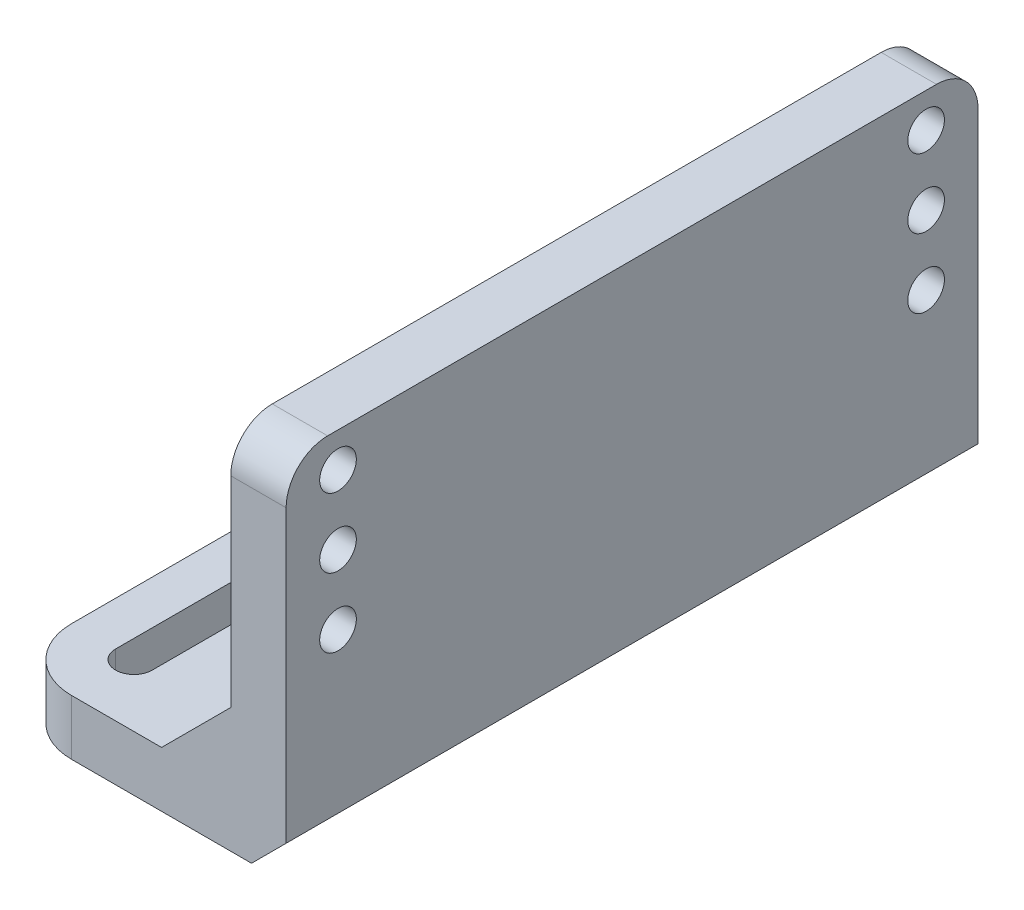
ISO-10303-21;
HEADER;
FILE_DESCRIPTION(('STEP AP214'),'2;1');
FILE_NAME('part.step','',(''),(''),'','','');
FILE_SCHEMA(('AUTOMOTIVE_DESIGN { 1 0 10303 214 1 1 1 1 }'));
ENDSEC;
DATA;
#1=APPLICATION_CONTEXT('core data for automotive mechanical design processes');
#2=APPLICATION_PROTOCOL_DEFINITION('international standard','automotive_design',2000,#1);
#3=PRODUCT_CONTEXT('',#1,'mechanical');
#4=PRODUCT('Part','Part','',(#3));
#5=PRODUCT_RELATED_PRODUCT_CATEGORY('part','',(#4));
#6=PRODUCT_DEFINITION_FORMATION('','',#4);
#7=PRODUCT_DEFINITION_CONTEXT('part definition',#1,'design');
#8=PRODUCT_DEFINITION('design','',#6,#7);
#9=PRODUCT_DEFINITION_SHAPE('','',#8);
#10=(LENGTH_UNIT() NAMED_UNIT(*) SI_UNIT(.MILLI.,.METRE.));
#11=(NAMED_UNIT(*) PLANE_ANGLE_UNIT() SI_UNIT($,.RADIAN.));
#12=(NAMED_UNIT(*) SI_UNIT($,.STERADIAN.) SOLID_ANGLE_UNIT());
#13=UNCERTAINTY_MEASURE_WITH_UNIT(LENGTH_MEASURE(1.E-05),#10,'distance_accuracy_value','');
#14=(GEOMETRIC_REPRESENTATION_CONTEXT(3) GLOBAL_UNCERTAINTY_ASSIGNED_CONTEXT((#13)) GLOBAL_UNIT_ASSIGNED_CONTEXT((#10,
#11,#12)) REPRESENTATION_CONTEXT('',''));
#15=CARTESIAN_POINT('',(0.,0.,0.));
#16=DIRECTION('',(0.,0.,1.));
#17=DIRECTION('',(1.,0.,0.));
#18=AXIS2_PLACEMENT_3D('',#15,#16,#17);
#19=CARTESIAN_POINT('',(0.,8.,0.));
#20=DIRECTION('',(-1.,0.,0.));
#21=DIRECTION('',(0.,0.,-1.));
#22=AXIS2_PLACEMENT_3D('',#19,#20,#21);
#23=PLANE('',#22);
#24=CARTESIAN_POINT('',(0.,38.,-92.5));
#25=DIRECTION('',(1.,0.,0.));
#26=DIRECTION('',(0.,0.,-1.));
#27=AXIS2_PLACEMENT_3D('',#24,#25,#26);
#28=CIRCLE('',#27,2.65);
#29=CARTESIAN_POINT('',(0.,38.,-95.15));
#30=VERTEX_POINT('',#29);
#31=EDGE_CURVE('E253',#30,#30,#28,.T.);
#32=ORIENTED_EDGE('',*,*,#31,.F.);
#33=EDGE_LOOP('',(#32));
#34=FACE_BOUND('',#33,.T.);
#35=CARTESIAN_POINT('',(0.,48.,-92.5));
#36=DIRECTION('',(1.,0.,0.));
#37=DIRECTION('',(0.,0.,-1.));
#38=AXIS2_PLACEMENT_3D('',#35,#36,#37);
#39=CIRCLE('',#38,2.65);
#40=CARTESIAN_POINT('',(0.,48.,-95.15));
#41=VERTEX_POINT('',#40);
#42=EDGE_CURVE('E260',#41,#41,#39,.T.);
#43=ORIENTED_EDGE('',*,*,#42,.F.);
#44=EDGE_LOOP('',(#43));
#45=FACE_BOUND('',#44,.T.);
#46=CARTESIAN_POINT('',(0.,48.,-7.5));
#47=DIRECTION('',(1.,0.,0.));
#48=DIRECTION('',(0.,0.,-1.));
#49=AXIS2_PLACEMENT_3D('',#46,#47,#48);
#50=CIRCLE('',#49,2.65);
#51=CARTESIAN_POINT('',(0.,48.,-10.15));
#52=VERTEX_POINT('',#51);
#53=EDGE_CURVE('E259',#52,#52,#50,.T.);
#54=ORIENTED_EDGE('',*,*,#53,.F.);
#55=EDGE_LOOP('',(#54));
#56=FACE_BOUND('',#55,.T.);
#57=CARTESIAN_POINT('',(0.,28.,-92.5));
#58=DIRECTION('',(1.,0.,0.));
#59=DIRECTION('',(0.,0.,-1.));
#60=AXIS2_PLACEMENT_3D('',#57,#58,#59);
#61=CIRCLE('',#60,2.65);
#62=CARTESIAN_POINT('',(0.,28.,-95.15));
#63=VERTEX_POINT('',#62);
#64=EDGE_CURVE('E272',#63,#63,#61,.T.);
#65=ORIENTED_EDGE('',*,*,#64,.F.);
#66=EDGE_LOOP('',(#65));
#67=FACE_BOUND('',#66,.T.);
#68=CARTESIAN_POINT('',(0.,38.,-7.50000000000001));
#69=DIRECTION('',(1.,0.,0.));
#70=DIRECTION('',(0.,0.,1.));
#71=AXIS2_PLACEMENT_3D('',#68,#69,#70);
#72=CIRCLE('',#71,2.65);
#73=CARTESIAN_POINT('',(0.,38.,-4.85));
#74=VERTEX_POINT('',#73);
#75=EDGE_CURVE('E215',#74,#74,#72,.T.);
#76=ORIENTED_EDGE('',*,*,#75,.F.);
#77=EDGE_LOOP('',(#76));
#78=FACE_BOUND('',#77,.T.);
#79=CARTESIAN_POINT('',(0.,28.,-7.5));
#80=DIRECTION('',(1.,0.,0.));
#81=DIRECTION('',(0.,0.,1.));
#82=AXIS2_PLACEMENT_3D('',#79,#80,#81);
#83=CIRCLE('',#82,2.65);
#84=CARTESIAN_POINT('',(0.,28.,-4.85));
#85=VERTEX_POINT('',#84);
#86=EDGE_CURVE('E280',#85,#85,#83,.T.);
#87=ORIENTED_EDGE('',*,*,#86,.F.);
#88=EDGE_LOOP('',(#87));
#89=FACE_BOUND('',#88,.T.);
#90=DIRECTION('',(0.,-1.,0.));
#91=VECTOR('',#90,1.);
#92=CARTESIAN_POINT('',(0.,8.,-100.));
#93=LINE('',#92,#91);
#94=CARTESIAN_POINT('',(0.,47.,-100.));
#95=VERTEX_POINT('',#94);
#96=CARTESIAN_POINT('',(0.,5.,-100.));
#97=VERTEX_POINT('',#96);
#98=EDGE_CURVE('E308',#95,#97,#93,.T.);
#99=ORIENTED_EDGE('',*,*,#98,.F.);
#100=CARTESIAN_POINT('',(0.,47.,-94.));
#101=DIRECTION('',(1.,0.,0.));
#102=DIRECTION('',(0.,0.,-1.));
#103=AXIS2_PLACEMENT_3D('',#100,#101,#102);
#104=CIRCLE('',#103,6.);
#105=CARTESIAN_POINT('',(0.,53.,-94.));
#106=VERTEX_POINT('',#105);
#107=EDGE_CURVE('E326',#106,#95,#104,.F.);
#108=ORIENTED_EDGE('',*,*,#107,.F.);
#109=DIRECTION('',(0.,0.,-1.));
#110=VECTOR('',#109,1.);
#111=CARTESIAN_POINT('',(0.,53.,-100.));
#112=LINE('',#111,#110);
#113=CARTESIAN_POINT('',(0.,53.,-6.00000000000001));
#114=VERTEX_POINT('',#113);
#115=EDGE_CURVE('E283',#114,#106,#112,.T.);
#116=ORIENTED_EDGE('',*,*,#115,.F.);
#117=CARTESIAN_POINT('',(0.,47.,-6.));
#118=DIRECTION('',(1.,0.,0.));
#119=DIRECTION('',(0.,0.,-1.));
#120=AXIS2_PLACEMENT_3D('',#117,#118,#119);
#121=CIRCLE('',#120,6.);
#122=CARTESIAN_POINT('',(0.,47.,0.));
#123=VERTEX_POINT('',#122);
#124=EDGE_CURVE('E323',#123,#114,#121,.F.);
#125=ORIENTED_EDGE('',*,*,#124,.F.);
#126=DIRECTION('',(0.,-1.,0.));
#127=VECTOR('',#126,1.);
#128=CARTESIAN_POINT('',(0.,8.,0.));
#129=LINE('',#128,#127);
#130=CARTESIAN_POINT('',(0.,5.,0.));
#131=VERTEX_POINT('',#130);
#132=EDGE_CURVE('E316',#123,#131,#129,.T.);
#133=ORIENTED_EDGE('',*,*,#132,.T.);
#134=DIRECTION('',(0.,0.,1.));
#135=VECTOR('',#134,1.);
#136=CARTESIAN_POINT('',(0.,5.,0.));
#137=LINE('',#136,#135);
#138=EDGE_CURVE('E369',#97,#131,#137,.T.);
#139=ORIENTED_EDGE('',*,*,#138,.F.);
#140=EDGE_LOOP('',(#99,#108,#116,#125,#133,#139));
#141=FACE_BOUND('',#140,.T.);
#142=ADVANCED_FACE('F40',(#34,#45,#56,#67,#78,#89,#141),#23,.F.);
#143=CARTESIAN_POINT('',(0.,8.,0.));
#144=DIRECTION('',(0.,0.,-1.));
#145=DIRECTION('',(1.,0.,0.));
#146=AXIS2_PLACEMENT_3D('',#143,#144,#145);
#147=PLANE('',#146);
#148=ORIENTED_EDGE('',*,*,#132,.F.);
#149=DIRECTION('',(1.,0.,0.));
#150=VECTOR('',#149,1.);
#151=CARTESIAN_POINT('',(0.,47.,0.));
#152=LINE('',#151,#150);
#153=CARTESIAN_POINT('',(-8.,47.,0.));
#154=VERTEX_POINT('',#153);
#155=EDGE_CURVE('E337',#154,#123,#152,.T.);
#156=ORIENTED_EDGE('',*,*,#155,.F.);
#157=DIRECTION('',(0.,1.,0.));
#158=VECTOR('',#157,1.);
#159=CARTESIAN_POINT('',(-8.,0.,0.));
#160=LINE('',#159,#158);
#161=CARTESIAN_POINT('',(-8.,17.9999999999999,0.));
#162=VERTEX_POINT('',#161);
#163=EDGE_CURVE('E289',#162,#154,#160,.T.);
#164=ORIENTED_EDGE('',*,*,#163,.F.);
#165=DIRECTION('',(0.707106781186551,0.707106781186544,0.));
#166=VECTOR('',#165,1.);
#167=CARTESIAN_POINT('',(-8.99999999999993,17.,0.));
#168=LINE('',#167,#166);
#169=CARTESIAN_POINT('',(-18.,8.,0.));
#170=VERTEX_POINT('',#169);
#171=EDGE_CURVE('E343',#170,#162,#168,.T.);
#172=ORIENTED_EDGE('',*,*,#171,.F.);
#173=DIRECTION('',(-1.,0.,0.));
#174=VECTOR('',#173,1.);
#175=CARTESIAN_POINT('',(0.,8.,0.));
#176=LINE('',#175,#174);
#177=CARTESIAN_POINT('',(-31.,8.,0.));
#178=VERTEX_POINT('',#177);
#179=EDGE_CURVE('E298',#170,#178,#176,.T.);
#180=ORIENTED_EDGE('',*,*,#179,.T.);
#181=DIRECTION('',(0.,-1.,0.));
#182=VECTOR('',#181,1.);
#183=CARTESIAN_POINT('',(-31.,8.,0.));
#184=LINE('',#183,#182);
#185=CARTESIAN_POINT('',(-31.,0.,0.));
#186=VERTEX_POINT('',#185);
#187=EDGE_CURVE('E366',#186,#178,#184,.F.);
#188=ORIENTED_EDGE('',*,*,#187,.F.);
#189=DIRECTION('',(-1.,0.,0.));
#190=VECTOR('',#189,1.);
#191=CARTESIAN_POINT('',(0.,0.,0.));
#192=LINE('',#191,#190);
#193=CARTESIAN_POINT('',(-5.00000000000002,0.,0.));
#194=VERTEX_POINT('',#193);
#195=EDGE_CURVE('E295',#194,#186,#192,.T.);
#196=ORIENTED_EDGE('',*,*,#195,.F.);
#197=DIRECTION('',(-0.707106781186549,-0.707106781186547,0.));
#198=VECTOR('',#197,1.);
#199=CARTESIAN_POINT('',(0.,5.,0.));
#200=LINE('',#199,#198);
#201=EDGE_CURVE('E372',#131,#194,#200,.T.);
#202=ORIENTED_EDGE('',*,*,#201,.F.);
#203=EDGE_LOOP('',(#148,#156,#164,#172,#180,#188,#196,#202));
#204=FACE_BOUND('',#203,.T.);
#205=ADVANCED_FACE('F378',(#204),#147,.F.);
#206=CARTESIAN_POINT('',(-40.,8.,0.));
#207=DIRECTION('',(1.,0.,0.));
#208=DIRECTION('',(0.,0.,1.));
#209=AXIS2_PLACEMENT_3D('',#206,#207,#208);
#210=PLANE('',#209);
#211=DIRECTION('',(0.,0.,-1.));
#212=VECTOR('',#211,1.);
#213=CARTESIAN_POINT('',(-40.,0.,0.));
#214=LINE('',#213,#212);
#215=CARTESIAN_POINT('',(-40.,0.,-8.99999999999998));
#216=VERTEX_POINT('',#215);
#217=CARTESIAN_POINT('',(-40.,0.,-91.));
#218=VERTEX_POINT('',#217);
#219=EDGE_CURVE('E310',#216,#218,#214,.T.);
#220=ORIENTED_EDGE('',*,*,#219,.F.);
#221=DIRECTION('',(0.,-1.,0.));
#222=VECTOR('',#221,1.);
#223=CARTESIAN_POINT('',(-40.,8.,-8.99999999999998));
#224=LINE('',#223,#222);
#225=CARTESIAN_POINT('',(-40.,8.,-8.99999999999998));
#226=VERTEX_POINT('',#225);
#227=EDGE_CURVE('E356',#226,#216,#224,.T.);
#228=ORIENTED_EDGE('',*,*,#227,.F.);
#229=DIRECTION('',(0.,0.,-1.));
#230=VECTOR('',#229,1.);
#231=CARTESIAN_POINT('',(-40.,8.,0.));
#232=LINE('',#231,#230);
#233=CARTESIAN_POINT('',(-40.,8.,-91.));
#234=VERTEX_POINT('',#233);
#235=EDGE_CURVE('E301',#226,#234,#232,.T.);
#236=ORIENTED_EDGE('',*,*,#235,.T.);
#237=DIRECTION('',(0.,-1.,0.));
#238=VECTOR('',#237,1.);
#239=CARTESIAN_POINT('',(-40.,8.,-91.));
#240=LINE('',#239,#238);
#241=EDGE_CURVE('E359',#218,#234,#240,.F.);
#242=ORIENTED_EDGE('',*,*,#241,.F.);
#243=EDGE_LOOP('',(#220,#228,#236,#242));
#244=FACE_BOUND('',#243,.T.);
#245=ADVANCED_FACE('F386',(#244),#210,.F.);
#246=CARTESIAN_POINT('',(0.,8.,-100.));
#247=DIRECTION('',(0.,0.,1.));
#248=DIRECTION('',(-1.,0.,0.));
#249=AXIS2_PLACEMENT_3D('',#246,#247,#248);
#250=PLANE('',#249);
#251=DIRECTION('',(1.,0.,0.));
#252=VECTOR('',#251,1.);
#253=CARTESIAN_POINT('',(0.,0.,-100.));
#254=LINE('',#253,#252);
#255=CARTESIAN_POINT('',(-31.,0.,-100.));
#256=VERTEX_POINT('',#255);
#257=CARTESIAN_POINT('',(-5.00000000000005,0.,-100.));
#258=VERTEX_POINT('',#257);
#259=EDGE_CURVE('E302',#256,#258,#254,.T.);
#260=ORIENTED_EDGE('',*,*,#259,.F.);
#261=DIRECTION('',(0.,-1.,0.));
#262=VECTOR('',#261,1.);
#263=CARTESIAN_POINT('',(-31.,8.,-100.));
#264=LINE('',#263,#262);
#265=CARTESIAN_POINT('',(-31.,8.,-100.));
#266=VERTEX_POINT('',#265);
#267=EDGE_CURVE('E349',#266,#256,#264,.T.);
#268=ORIENTED_EDGE('',*,*,#267,.F.);
#269=DIRECTION('',(1.,0.,0.));
#270=VECTOR('',#269,1.);
#271=CARTESIAN_POINT('',(0.,8.,-100.));
#272=LINE('',#271,#270);
#273=CARTESIAN_POINT('',(-18.0000000000001,8.,-100.));
#274=VERTEX_POINT('',#273);
#275=EDGE_CURVE('E305',#266,#274,#272,.T.);
#276=ORIENTED_EDGE('',*,*,#275,.T.);
#277=DIRECTION('',(-0.707106781186551,-0.707106781186544,0.));
#278=VECTOR('',#277,1.);
#279=CARTESIAN_POINT('',(-8.99999999999996,17.,-100.));
#280=LINE('',#279,#278);
#281=CARTESIAN_POINT('',(-8.00000000000004,17.9999999999999,-100.));
#282=VERTEX_POINT('',#281);
#283=EDGE_CURVE('E346',#282,#274,#280,.T.);
#284=ORIENTED_EDGE('',*,*,#283,.F.);
#285=DIRECTION('',(0.,-1.,0.));
#286=VECTOR('',#285,1.);
#287=CARTESIAN_POINT('',(-8.00000000000004,0.,-100.));
#288=LINE('',#287,#286);
#289=CARTESIAN_POINT('',(-8.00000000000004,47.,-100.));
#290=VERTEX_POINT('',#289);
#291=EDGE_CURVE('E286',#290,#282,#288,.T.);
#292=ORIENTED_EDGE('',*,*,#291,.F.);
#293=DIRECTION('',(1.,0.,0.));
#294=VECTOR('',#293,1.);
#295=CARTESIAN_POINT('',(-8.00000000000004,47.,-100.));
#296=LINE('',#295,#294);
#297=EDGE_CURVE('E329',#95,#290,#296,.F.);
#298=ORIENTED_EDGE('',*,*,#297,.F.);
#299=ORIENTED_EDGE('',*,*,#98,.T.);
#300=DIRECTION('',(0.707106781186549,0.707106781186547,0.));
#301=VECTOR('',#300,1.);
#302=CARTESIAN_POINT('',(0.,4.99999999999999,-100.));
#303=LINE('',#302,#301);
#304=EDGE_CURVE('E11',#258,#97,#303,.T.);
#305=ORIENTED_EDGE('',*,*,#304,.F.);
#306=EDGE_LOOP('',(#260,#268,#276,#284,#292,#298,#299,#305));
#307=FACE_BOUND('',#306,.T.);
#308=ADVANCED_FACE('F393',(#307),#250,.F.);
#309=CARTESIAN_POINT('',(0.,8.,0.));
#310=DIRECTION('',(0.,-1.,0.));
#311=DIRECTION('',(0.,0.,-1.));
#312=AXIS2_PLACEMENT_3D('',#309,#310,#311);
#313=PLANE('',#312);
#314=DIRECTION('',(0.,0.,1.));
#315=VECTOR('',#314,1.);
#316=CARTESIAN_POINT('',(-28.35,8.,-91.));
#317=LINE('',#316,#315);
#318=CARTESIAN_POINT('',(-28.35,8.,-91.));
#319=VERTEX_POINT('',#318);
#320=CARTESIAN_POINT('',(-28.35,8.,-66.));
#321=VERTEX_POINT('',#320);
#322=EDGE_CURVE('E180',#319,#321,#317,.T.);
#323=ORIENTED_EDGE('',*,*,#322,.T.);
#324=CARTESIAN_POINT('',(-31.,8.,-66.));
#325=DIRECTION('',(0.,-1.,0.));
#326=DIRECTION('',(0.,0.,1.));
#327=AXIS2_PLACEMENT_3D('',#324,#325,#326);
#328=CIRCLE('',#327,2.65);
#329=CARTESIAN_POINT('',(-33.65,8.,-66.));
#330=VERTEX_POINT('',#329);
#331=EDGE_CURVE('E203',#321,#330,#328,.T.);
#332=ORIENTED_EDGE('',*,*,#331,.T.);
#333=DIRECTION('',(0.,0.,-1.));
#334=VECTOR('',#333,1.);
#335=CARTESIAN_POINT('',(-33.65,8.,-91.));
#336=LINE('',#335,#334);
#337=CARTESIAN_POINT('',(-33.65,8.,-91.));
#338=VERTEX_POINT('',#337);
#339=EDGE_CURVE('E200',#330,#338,#336,.T.);
#340=ORIENTED_EDGE('',*,*,#339,.T.);
#341=CARTESIAN_POINT('',(-31.,8.,-91.));
#342=DIRECTION('',(0.,-1.,0.));
#343=DIRECTION('',(0.,0.,1.));
#344=AXIS2_PLACEMENT_3D('',#341,#342,#343);
#345=CIRCLE('',#344,2.65);
#346=EDGE_CURVE('E208',#338,#319,#345,.T.);
#347=ORIENTED_EDGE('',*,*,#346,.T.);
#348=EDGE_LOOP('',(#323,#332,#340,#347));
#349=FACE_BOUND('',#348,.T.);
#350=DIRECTION('',(0.,0.,1.));
#351=VECTOR('',#350,1.);
#352=CARTESIAN_POINT('',(-28.35,8.,-34.));
#353=LINE('',#352,#351);
#354=CARTESIAN_POINT('',(-28.35,8.,-34.));
#355=VERTEX_POINT('',#354);
#356=CARTESIAN_POINT('',(-28.35,8.,-8.99999999999998));
#357=VERTEX_POINT('',#356);
#358=EDGE_CURVE('E235',#355,#357,#353,.T.);
#359=ORIENTED_EDGE('',*,*,#358,.T.);
#360=CARTESIAN_POINT('',(-31.,8.,-8.99999999999998));
#361=DIRECTION('',(0.,-1.,0.));
#362=DIRECTION('',(0.,0.,1.));
#363=AXIS2_PLACEMENT_3D('',#360,#361,#362);
#364=CIRCLE('',#363,2.64999999999999);
#365=CARTESIAN_POINT('',(-33.65,8.,-8.99999999999998));
#366=VERTEX_POINT('',#365);
#367=EDGE_CURVE('E231',#357,#366,#364,.T.);
#368=ORIENTED_EDGE('',*,*,#367,.T.);
#369=DIRECTION('',(0.,0.,-1.));
#370=VECTOR('',#369,1.);
#371=CARTESIAN_POINT('',(-33.65,8.,-34.));
#372=LINE('',#371,#370);
#373=CARTESIAN_POINT('',(-33.65,8.,-34.));
#374=VERTEX_POINT('',#373);
#375=EDGE_CURVE('E228',#366,#374,#372,.T.);
#376=ORIENTED_EDGE('',*,*,#375,.T.);
#377=CARTESIAN_POINT('',(-31.,8.,-34.));
#378=DIRECTION('',(0.,-1.,0.));
#379=DIRECTION('',(0.,0.,1.));
#380=AXIS2_PLACEMENT_3D('',#377,#378,#379);
#381=CIRCLE('',#380,2.65);
#382=EDGE_CURVE('E210',#374,#355,#381,.T.);
#383=ORIENTED_EDGE('',*,*,#382,.T.);
#384=EDGE_LOOP('',(#359,#368,#376,#383));
#385=FACE_BOUND('',#384,.T.);
#386=ORIENTED_EDGE('',*,*,#235,.F.);
#387=CARTESIAN_POINT('',(-31.,8.,-8.99999999999998));
#388=DIRECTION('',(0.,1.,0.));
#389=DIRECTION('',(0.,0.,-1.));
#390=AXIS2_PLACEMENT_3D('',#387,#388,#389);
#391=CIRCLE('',#390,9.);
#392=EDGE_CURVE('E362',#178,#226,#391,.F.);
#393=ORIENTED_EDGE('',*,*,#392,.F.);
#394=ORIENTED_EDGE('',*,*,#179,.F.);
#395=DIRECTION('',(0.,0.,1.));
#396=VECTOR('',#395,1.);
#397=CARTESIAN_POINT('',(-18.,8.,0.));
#398=LINE('',#397,#396);
#399=EDGE_CURVE('E339',#274,#170,#398,.T.);
#400=ORIENTED_EDGE('',*,*,#399,.F.);
#401=ORIENTED_EDGE('',*,*,#275,.F.);
#402=CARTESIAN_POINT('',(-31.,8.,-91.));
#403=DIRECTION('',(0.,1.,0.));
#404=DIRECTION('',(0.,0.,-1.));
#405=AXIS2_PLACEMENT_3D('',#402,#403,#404);
#406=CIRCLE('',#405,9.);
#407=EDGE_CURVE('E364',#234,#266,#406,.F.);
#408=ORIENTED_EDGE('',*,*,#407,.F.);
#409=EDGE_LOOP('',(#386,#393,#394,#400,#401,#408));
#410=FACE_BOUND('',#409,.T.);
#411=ADVANCED_FACE('F414',(#349,#385,#410),#313,.F.);
#412=CARTESIAN_POINT('',(0.,0.,0.));
#413=DIRECTION('',(0.,-1.,0.));
#414=DIRECTION('',(0.,0.,-1.));
#415=AXIS2_PLACEMENT_3D('',#412,#413,#414);
#416=PLANE('',#415);
#417=CARTESIAN_POINT('',(-31.,0.,-91.));
#418=DIRECTION('',(0.,-1.,0.));
#419=DIRECTION('',(0.,0.,1.));
#420=AXIS2_PLACEMENT_3D('',#417,#418,#419);
#421=CIRCLE('',#420,2.65);
#422=CARTESIAN_POINT('',(-33.65,0.,-91.));
#423=VERTEX_POINT('',#422);
#424=CARTESIAN_POINT('',(-28.35,0.,-91.));
#425=VERTEX_POINT('',#424);
#426=EDGE_CURVE('E193',#423,#425,#421,.T.);
#427=ORIENTED_EDGE('',*,*,#426,.F.);
#428=DIRECTION('',(0.,0.,-1.));
#429=VECTOR('',#428,1.);
#430=CARTESIAN_POINT('',(-33.65,0.,-91.));
#431=LINE('',#430,#429);
#432=CARTESIAN_POINT('',(-33.65,0.,-66.));
#433=VERTEX_POINT('',#432);
#434=EDGE_CURVE('E186',#433,#423,#431,.T.);
#435=ORIENTED_EDGE('',*,*,#434,.F.);
#436=CARTESIAN_POINT('',(-31.,0.,-66.));
#437=DIRECTION('',(0.,-1.,0.));
#438=DIRECTION('',(0.,0.,1.));
#439=AXIS2_PLACEMENT_3D('',#436,#437,#438);
#440=CIRCLE('',#439,2.65);
#441=CARTESIAN_POINT('',(-28.35,0.,-66.));
#442=VERTEX_POINT('',#441);
#443=EDGE_CURVE('E195',#442,#433,#440,.T.);
#444=ORIENTED_EDGE('',*,*,#443,.F.);
#445=DIRECTION('',(0.,0.,1.));
#446=VECTOR('',#445,1.);
#447=CARTESIAN_POINT('',(-28.35,0.,-91.));
#448=LINE('',#447,#446);
#449=EDGE_CURVE('E177',#425,#442,#448,.T.);
#450=ORIENTED_EDGE('',*,*,#449,.F.);
#451=EDGE_LOOP('',(#427,#435,#444,#450));
#452=FACE_BOUND('',#451,.T.);
#453=CARTESIAN_POINT('',(-31.,0.,-34.));
#454=DIRECTION('',(0.,-1.,0.));
#455=DIRECTION('',(0.,0.,1.));
#456=AXIS2_PLACEMENT_3D('',#453,#454,#455);
#457=CIRCLE('',#456,2.65);
#458=CARTESIAN_POINT('',(-33.65,0.,-34.));
#459=VERTEX_POINT('',#458);
#460=CARTESIAN_POINT('',(-28.35,0.,-34.));
#461=VERTEX_POINT('',#460);
#462=EDGE_CURVE('E232',#459,#461,#457,.T.);
#463=ORIENTED_EDGE('',*,*,#462,.F.);
#464=DIRECTION('',(0.,0.,-1.));
#465=VECTOR('',#464,1.);
#466=CARTESIAN_POINT('',(-33.65,0.,-34.));
#467=LINE('',#466,#465);
#468=CARTESIAN_POINT('',(-33.65,0.,-8.99999999999998));
#469=VERTEX_POINT('',#468);
#470=EDGE_CURVE('E221',#469,#459,#467,.T.);
#471=ORIENTED_EDGE('',*,*,#470,.F.);
#472=CARTESIAN_POINT('',(-31.,0.,-8.99999999999998));
#473=DIRECTION('',(0.,-1.,0.));
#474=DIRECTION('',(0.,0.,1.));
#475=AXIS2_PLACEMENT_3D('',#472,#473,#474);
#476=CIRCLE('',#475,2.64999999999999);
#477=CARTESIAN_POINT('',(-28.35,0.,-8.99999999999998));
#478=VERTEX_POINT('',#477);
#479=EDGE_CURVE('E242',#478,#469,#476,.T.);
#480=ORIENTED_EDGE('',*,*,#479,.F.);
#481=DIRECTION('',(0.,0.,1.));
#482=VECTOR('',#481,1.);
#483=CARTESIAN_POINT('',(-28.35,0.,-34.));
#484=LINE('',#483,#482);
#485=EDGE_CURVE('E245',#461,#478,#484,.T.);
#486=ORIENTED_EDGE('',*,*,#485,.F.);
#487=EDGE_LOOP('',(#463,#471,#480,#486));
#488=FACE_BOUND('',#487,.T.);
#489=ORIENTED_EDGE('',*,*,#195,.T.);
#490=CARTESIAN_POINT('',(-31.,0.,-8.99999999999998));
#491=DIRECTION('',(0.,1.,0.));
#492=DIRECTION('',(0.,0.,-1.));
#493=AXIS2_PLACEMENT_3D('',#490,#491,#492);
#494=CIRCLE('',#493,9.);
#495=EDGE_CURVE('E352',#216,#186,#494,.T.);
#496=ORIENTED_EDGE('',*,*,#495,.F.);
#497=ORIENTED_EDGE('',*,*,#219,.T.);
#498=CARTESIAN_POINT('',(-31.,0.,-91.));
#499=DIRECTION('',(0.,1.,0.));
#500=DIRECTION('',(0.,0.,-1.));
#501=AXIS2_PLACEMENT_3D('',#498,#499,#500);
#502=CIRCLE('',#501,9.);
#503=EDGE_CURVE('E354',#256,#218,#502,.T.);
#504=ORIENTED_EDGE('',*,*,#503,.F.);
#505=ORIENTED_EDGE('',*,*,#259,.T.);
#506=DIRECTION('',(0.,0.,-1.));
#507=VECTOR('',#506,1.);
#508=CARTESIAN_POINT('',(-5.00000000000005,0.,-100.));
#509=LINE('',#508,#507);
#510=EDGE_CURVE('E48',#194,#258,#509,.T.);
#511=ORIENTED_EDGE('',*,*,#510,.F.);
#512=EDGE_LOOP('',(#489,#496,#497,#504,#505,#511));
#513=FACE_BOUND('',#512,.T.);
#514=ADVANCED_FACE('F190',(#452,#488,#513),#416,.T.);
#515=CARTESIAN_POINT('',(-8.,0.,0.));
#516=DIRECTION('',(-1.,0.,0.));
#517=DIRECTION('',(0.,0.,-1.));
#518=AXIS2_PLACEMENT_3D('',#515,#516,#517);
#519=PLANE('',#518);
#520=CARTESIAN_POINT('',(-8.00000000000004,38.,-92.5));
#521=DIRECTION('',(1.,0.,0.));
#522=DIRECTION('',(0.,0.,-1.));
#523=AXIS2_PLACEMENT_3D('',#520,#521,#522);
#524=CIRCLE('',#523,2.65);
#525=CARTESIAN_POINT('',(-8.00000000000004,38.,-95.15));
#526=VERTEX_POINT('',#525);
#527=EDGE_CURVE('E263',#526,#526,#524,.T.);
#528=ORIENTED_EDGE('',*,*,#527,.T.);
#529=EDGE_LOOP('',(#528));
#530=FACE_BOUND('',#529,.T.);
#531=CARTESIAN_POINT('',(-8.00000000000004,48.,-92.5));
#532=DIRECTION('',(1.,0.,0.));
#533=DIRECTION('',(0.,0.,-1.));
#534=AXIS2_PLACEMENT_3D('',#531,#532,#533);
#535=CIRCLE('',#534,2.65);
#536=CARTESIAN_POINT('',(-8.00000000000004,48.,-95.15));
#537=VERTEX_POINT('',#536);
#538=EDGE_CURVE('E256',#537,#537,#535,.T.);
#539=ORIENTED_EDGE('',*,*,#538,.T.);
#540=EDGE_LOOP('',(#539));
#541=FACE_BOUND('',#540,.T.);
#542=CARTESIAN_POINT('',(-8.,48.,-7.49999999999999));
#543=DIRECTION('',(1.,0.,0.));
#544=DIRECTION('',(0.,0.,-1.));
#545=AXIS2_PLACEMENT_3D('',#542,#543,#544);
#546=CIRCLE('',#545,2.65);
#547=CARTESIAN_POINT('',(-8.,48.,-10.15));
#548=VERTEX_POINT('',#547);
#549=EDGE_CURVE('E275',#548,#548,#546,.T.);
#550=ORIENTED_EDGE('',*,*,#549,.T.);
#551=EDGE_LOOP('',(#550));
#552=FACE_BOUND('',#551,.T.);
#553=CARTESIAN_POINT('',(-8.00000000000004,28.,-92.5));
#554=DIRECTION('',(1.,0.,0.));
#555=DIRECTION('',(0.,0.,-1.));
#556=AXIS2_PLACEMENT_3D('',#553,#554,#555);
#557=CIRCLE('',#556,2.65);
#558=CARTESIAN_POINT('',(-8.00000000000004,28.,-95.15));
#559=VERTEX_POINT('',#558);
#560=EDGE_CURVE('E268',#559,#559,#557,.T.);
#561=ORIENTED_EDGE('',*,*,#560,.T.);
#562=EDGE_LOOP('',(#561));
#563=FACE_BOUND('',#562,.T.);
#564=CARTESIAN_POINT('',(-8.,38.,-7.5));
#565=DIRECTION('',(1.,0.,0.));
#566=DIRECTION('',(0.,0.,1.));
#567=AXIS2_PLACEMENT_3D('',#564,#565,#566);
#568=CIRCLE('',#567,2.65);
#569=CARTESIAN_POINT('',(-8.,38.,-4.85));
#570=VERTEX_POINT('',#569);
#571=EDGE_CURVE('E250',#570,#570,#568,.T.);
#572=ORIENTED_EDGE('',*,*,#571,.T.);
#573=EDGE_LOOP('',(#572));
#574=FACE_BOUND('',#573,.T.);
#575=CARTESIAN_POINT('',(-8.,28.,-7.5));
#576=DIRECTION('',(1.,0.,0.));
#577=DIRECTION('',(0.,0.,1.));
#578=AXIS2_PLACEMENT_3D('',#575,#576,#577);
#579=CIRCLE('',#578,2.65);
#580=CARTESIAN_POINT('',(-8.,28.,-4.85));
#581=VERTEX_POINT('',#580);
#582=EDGE_CURVE('E271',#581,#581,#579,.T.);
#583=ORIENTED_EDGE('',*,*,#582,.T.);
#584=EDGE_LOOP('',(#583));
#585=FACE_BOUND('',#584,.T.);
#586=ORIENTED_EDGE('',*,*,#163,.T.);
#587=CARTESIAN_POINT('',(-8.,47.,-6.));
#588=DIRECTION('',(1.,0.,0.));
#589=DIRECTION('',(0.,0.,-1.));
#590=AXIS2_PLACEMENT_3D('',#587,#588,#589);
#591=CIRCLE('',#590,6.);
#592=CARTESIAN_POINT('',(-8.,53.,-6.));
#593=VERTEX_POINT('',#592);
#594=EDGE_CURVE('E332',#593,#154,#591,.T.);
#595=ORIENTED_EDGE('',*,*,#594,.F.);
#596=DIRECTION('',(0.,0.,-1.));
#597=VECTOR('',#596,1.);
#598=CARTESIAN_POINT('',(-8.00000000000004,53.,-100.));
#599=LINE('',#598,#597);
#600=CARTESIAN_POINT('',(-8.00000000000004,53.,-94.));
#601=VERTEX_POINT('',#600);
#602=EDGE_CURVE('E292',#593,#601,#599,.T.);
#603=ORIENTED_EDGE('',*,*,#602,.T.);
#604=CARTESIAN_POINT('',(-8.00000000000004,47.,-94.));
#605=DIRECTION('',(1.,0.,0.));
#606=DIRECTION('',(0.,0.,-1.));
#607=AXIS2_PLACEMENT_3D('',#604,#605,#606);
#608=CIRCLE('',#607,6.);
#609=EDGE_CURVE('E334',#290,#601,#608,.T.);
#610=ORIENTED_EDGE('',*,*,#609,.F.);
#611=ORIENTED_EDGE('',*,*,#291,.T.);
#612=DIRECTION('',(0.,0.,-1.));
#613=VECTOR('',#612,1.);
#614=CARTESIAN_POINT('',(-8.,17.9999999999999,0.));
#615=LINE('',#614,#613);
#616=EDGE_CURVE('E341',#162,#282,#615,.T.);
#617=ORIENTED_EDGE('',*,*,#616,.F.);
#618=EDGE_LOOP('',(#586,#595,#603,#610,#611,#617));
#619=FACE_BOUND('',#618,.T.);
#620=ADVANCED_FACE('F407',(#530,#541,#552,#563,#574,#585,#619),#519,.T.);
#621=CARTESIAN_POINT('',(-8.00000000000004,53.,-100.));
#622=DIRECTION('',(0.,1.,0.));
#623=DIRECTION('',(0.,0.,1.));
#624=AXIS2_PLACEMENT_3D('',#621,#622,#623);
#625=PLANE('',#624);
#626=ORIENTED_EDGE('',*,*,#602,.F.);
#627=DIRECTION('',(1.,0.,0.));
#628=VECTOR('',#627,1.);
#629=CARTESIAN_POINT('',(-8.,53.,-6.));
#630=LINE('',#629,#628);
#631=EDGE_CURVE('E319',#114,#593,#630,.F.);
#632=ORIENTED_EDGE('',*,*,#631,.F.);
#633=ORIENTED_EDGE('',*,*,#115,.T.);
#634=DIRECTION('',(1.,0.,0.));
#635=VECTOR('',#634,1.);
#636=CARTESIAN_POINT('',(0.,53.,-94.));
#637=LINE('',#636,#635);
#638=EDGE_CURVE('E321',#601,#106,#637,.T.);
#639=ORIENTED_EDGE('',*,*,#638,.F.);
#640=EDGE_LOOP('',(#626,#632,#633,#639));
#641=FACE_BOUND('',#640,.T.);
#642=ADVANCED_FACE('F418',(#641),#625,.T.);
#643=CARTESIAN_POINT('',(0.,28.,-7.5));
#644=DIRECTION('',(-1.,0.,0.));
#645=DIRECTION('',(0.,0.,-1.));
#646=AXIS2_PLACEMENT_3D('',#643,#644,#645);
#647=CYLINDRICAL_SURFACE('',#646,2.65);
#648=ORIENTED_EDGE('',*,*,#86,.T.);
#649=EDGE_LOOP('',(#648));
#650=FACE_BOUND('',#649,.T.);
#651=ORIENTED_EDGE('',*,*,#582,.F.);
#652=EDGE_LOOP('',(#651));
#653=FACE_BOUND('',#652,.T.);
#654=ADVANCED_FACE('F420',(#650,#653),#647,.F.);
#655=CARTESIAN_POINT('',(0.,38.,-7.50000000000001));
#656=DIRECTION('',(-1.,0.,0.));
#657=DIRECTION('',(0.,0.,-1.));
#658=AXIS2_PLACEMENT_3D('',#655,#656,#657);
#659=CYLINDRICAL_SURFACE('',#658,2.65);
#660=ORIENTED_EDGE('',*,*,#75,.T.);
#661=EDGE_LOOP('',(#660));
#662=FACE_BOUND('',#661,.T.);
#663=ORIENTED_EDGE('',*,*,#571,.F.);
#664=EDGE_LOOP('',(#663));
#665=FACE_BOUND('',#664,.T.);
#666=ADVANCED_FACE('F426',(#662,#665),#659,.F.);
#667=CARTESIAN_POINT('',(0.,28.,-92.5));
#668=DIRECTION('',(-1.,0.,0.));
#669=DIRECTION('',(0.,0.,-1.));
#670=AXIS2_PLACEMENT_3D('',#667,#668,#669);
#671=CYLINDRICAL_SURFACE('',#670,2.65);
#672=ORIENTED_EDGE('',*,*,#64,.T.);
#673=EDGE_LOOP('',(#672));
#674=FACE_BOUND('',#673,.T.);
#675=ORIENTED_EDGE('',*,*,#560,.F.);
#676=EDGE_LOOP('',(#675));
#677=FACE_BOUND('',#676,.T.);
#678=ADVANCED_FACE('F478',(#674,#677),#671,.F.);
#679=CARTESIAN_POINT('',(0.,48.,-7.5));
#680=DIRECTION('',(-1.,0.,0.));
#681=DIRECTION('',(0.,0.,-1.));
#682=AXIS2_PLACEMENT_3D('',#679,#680,#681);
#683=CYLINDRICAL_SURFACE('',#682,2.65);
#684=ORIENTED_EDGE('',*,*,#53,.T.);
#685=EDGE_LOOP('',(#684));
#686=FACE_BOUND('',#685,.T.);
#687=ORIENTED_EDGE('',*,*,#549,.F.);
#688=EDGE_LOOP('',(#687));
#689=FACE_BOUND('',#688,.T.);
#690=ADVANCED_FACE('F483',(#686,#689),#683,.F.);
#691=CARTESIAN_POINT('',(0.,48.,-92.5));
#692=DIRECTION('',(-1.,0.,0.));
#693=DIRECTION('',(0.,0.,-1.));
#694=AXIS2_PLACEMENT_3D('',#691,#692,#693);
#695=CYLINDRICAL_SURFACE('',#694,2.65);
#696=ORIENTED_EDGE('',*,*,#42,.T.);
#697=EDGE_LOOP('',(#696));
#698=FACE_BOUND('',#697,.T.);
#699=ORIENTED_EDGE('',*,*,#538,.F.);
#700=EDGE_LOOP('',(#699));
#701=FACE_BOUND('',#700,.T.);
#702=ADVANCED_FACE('F480',(#698,#701),#695,.F.);
#703=CARTESIAN_POINT('',(0.,38.,-92.5));
#704=DIRECTION('',(-1.,0.,0.));
#705=DIRECTION('',(0.,0.,-1.));
#706=AXIS2_PLACEMENT_3D('',#703,#704,#705);
#707=CYLINDRICAL_SURFACE('',#706,2.65);
#708=ORIENTED_EDGE('',*,*,#31,.T.);
#709=EDGE_LOOP('',(#708));
#710=FACE_BOUND('',#709,.T.);
#711=ORIENTED_EDGE('',*,*,#527,.F.);
#712=EDGE_LOOP('',(#711));
#713=FACE_BOUND('',#712,.T.);
#714=ADVANCED_FACE('F445',(#710,#713),#707,.F.);
#715=CARTESIAN_POINT('',(-8.00000000000004,47.,-94.));
#716=DIRECTION('',(-1.,0.,0.));
#717=DIRECTION('',(0.,0.,-1.));
#718=AXIS2_PLACEMENT_3D('',#715,#716,#717);
#719=CYLINDRICAL_SURFACE('',#718,6.);
#720=ORIENTED_EDGE('',*,*,#609,.T.);
#721=ORIENTED_EDGE('',*,*,#638,.T.);
#722=ORIENTED_EDGE('',*,*,#107,.T.);
#723=ORIENTED_EDGE('',*,*,#297,.T.);
#724=EDGE_LOOP('',(#720,#721,#722,#723));
#725=FACE_BOUND('',#724,.T.);
#726=ADVANCED_FACE('F416',(#725),#719,.T.);
#727=CARTESIAN_POINT('',(0.,47.,-6.));
#728=DIRECTION('',(-1.,0.,0.));
#729=DIRECTION('',(0.,0.,-1.));
#730=AXIS2_PLACEMENT_3D('',#727,#728,#729);
#731=CYLINDRICAL_SURFACE('',#730,6.);
#732=ORIENTED_EDGE('',*,*,#594,.T.);
#733=ORIENTED_EDGE('',*,*,#155,.T.);
#734=ORIENTED_EDGE('',*,*,#124,.T.);
#735=ORIENTED_EDGE('',*,*,#631,.T.);
#736=EDGE_LOOP('',(#732,#733,#734,#735));
#737=FACE_BOUND('',#736,.T.);
#738=ADVANCED_FACE('F403',(#737),#731,.T.);
#739=CARTESIAN_POINT('',(-18.,8.,0.));
#740=DIRECTION('',(0.707106781186544,-0.707106781186551,0.));
#741=DIRECTION('',(0.,0.,1.));
#742=AXIS2_PLACEMENT_3D('',#739,#740,#741);
#743=PLANE('',#742);
#744=ORIENTED_EDGE('',*,*,#283,.T.);
#745=ORIENTED_EDGE('',*,*,#399,.T.);
#746=ORIENTED_EDGE('',*,*,#171,.T.);
#747=ORIENTED_EDGE('',*,*,#616,.T.);
#748=EDGE_LOOP('',(#744,#745,#746,#747));
#749=FACE_BOUND('',#748,.T.);
#750=ADVANCED_FACE('F411',(#749),#743,.F.);
#751=CARTESIAN_POINT('',(-31.,8.,-91.));
#752=DIRECTION('',(0.,-1.,0.));
#753=DIRECTION('',(0.,0.,-1.));
#754=AXIS2_PLACEMENT_3D('',#751,#752,#753);
#755=CYLINDRICAL_SURFACE('',#754,9.);
#756=ORIENTED_EDGE('',*,*,#407,.T.);
#757=ORIENTED_EDGE('',*,*,#267,.T.);
#758=ORIENTED_EDGE('',*,*,#503,.T.);
#759=ORIENTED_EDGE('',*,*,#241,.T.);
#760=EDGE_LOOP('',(#756,#757,#758,#759));
#761=FACE_BOUND('',#760,.T.);
#762=ADVANCED_FACE('F388',(#761),#755,.T.);
#763=CARTESIAN_POINT('',(-31.,8.,-8.99999999999998));
#764=DIRECTION('',(0.,-1.,0.));
#765=DIRECTION('',(0.,0.,-1.));
#766=AXIS2_PLACEMENT_3D('',#763,#764,#765);
#767=CYLINDRICAL_SURFACE('',#766,9.);
#768=ORIENTED_EDGE('',*,*,#392,.T.);
#769=ORIENTED_EDGE('',*,*,#227,.T.);
#770=ORIENTED_EDGE('',*,*,#495,.T.);
#771=ORIENTED_EDGE('',*,*,#187,.T.);
#772=EDGE_LOOP('',(#768,#769,#770,#771));
#773=FACE_BOUND('',#772,.T.);
#774=ADVANCED_FACE('F382',(#773),#767,.T.);
#775=CARTESIAN_POINT('',(-31.,0.,-34.));
#776=DIRECTION('',(0.,1.,0.));
#777=DIRECTION('',(0.,0.,1.));
#778=AXIS2_PLACEMENT_3D('',#775,#776,#777);
#779=CYLINDRICAL_SURFACE('',#778,2.65);
#780=ORIENTED_EDGE('',*,*,#382,.F.);
#781=DIRECTION('',(0.,1.,0.));
#782=VECTOR('',#781,1.);
#783=CARTESIAN_POINT('',(-33.65,0.,-34.));
#784=LINE('',#783,#782);
#785=EDGE_CURVE('E226',#459,#374,#784,.T.);
#786=ORIENTED_EDGE('',*,*,#785,.F.);
#787=ORIENTED_EDGE('',*,*,#462,.T.);
#788=DIRECTION('',(0.,1.,0.));
#789=VECTOR('',#788,1.);
#790=CARTESIAN_POINT('',(-28.35,0.,-34.));
#791=LINE('',#790,#789);
#792=EDGE_CURVE('E219',#461,#355,#791,.T.);
#793=ORIENTED_EDGE('',*,*,#792,.T.);
#794=EDGE_LOOP('',(#780,#786,#787,#793));
#795=FACE_BOUND('',#794,.T.);
#796=ADVANCED_FACE('F452',(#795),#779,.F.);
#797=CARTESIAN_POINT('',(-33.65,0.,-34.));
#798=DIRECTION('',(-1.,0.,0.));
#799=DIRECTION('',(0.,0.,-1.));
#800=AXIS2_PLACEMENT_3D('',#797,#798,#799);
#801=PLANE('',#800);
#802=ORIENTED_EDGE('',*,*,#375,.F.);
#803=DIRECTION('',(0.,1.,0.));
#804=VECTOR('',#803,1.);
#805=CARTESIAN_POINT('',(-33.65,0.,-8.99999999999998));
#806=LINE('',#805,#804);
#807=EDGE_CURVE('E224',#469,#366,#806,.T.);
#808=ORIENTED_EDGE('',*,*,#807,.F.);
#809=ORIENTED_EDGE('',*,*,#470,.T.);
#810=ORIENTED_EDGE('',*,*,#785,.T.);
#811=EDGE_LOOP('',(#802,#808,#809,#810));
#812=FACE_BOUND('',#811,.T.);
#813=ADVANCED_FACE('F456',(#812),#801,.F.);
#814=CARTESIAN_POINT('',(-31.,0.,-8.99999999999998));
#815=DIRECTION('',(0.,1.,0.));
#816=DIRECTION('',(0.,0.,1.));
#817=AXIS2_PLACEMENT_3D('',#814,#815,#816);
#818=CYLINDRICAL_SURFACE('',#817,2.64999999999999);
#819=ORIENTED_EDGE('',*,*,#367,.F.);
#820=DIRECTION('',(0.,1.,0.));
#821=VECTOR('',#820,1.);
#822=CARTESIAN_POINT('',(-28.35,0.,-8.99999999999998));
#823=LINE('',#822,#821);
#824=EDGE_CURVE('E222',#478,#357,#823,.T.);
#825=ORIENTED_EDGE('',*,*,#824,.F.);
#826=ORIENTED_EDGE('',*,*,#479,.T.);
#827=ORIENTED_EDGE('',*,*,#807,.T.);
#828=EDGE_LOOP('',(#819,#825,#826,#827));
#829=FACE_BOUND('',#828,.T.);
#830=ADVANCED_FACE('F462',(#829),#818,.F.);
#831=CARTESIAN_POINT('',(-28.35,0.,-34.));
#832=DIRECTION('',(1.,0.,0.));
#833=DIRECTION('',(0.,0.,1.));
#834=AXIS2_PLACEMENT_3D('',#831,#832,#833);
#835=PLANE('',#834);
#836=ORIENTED_EDGE('',*,*,#358,.F.);
#837=ORIENTED_EDGE('',*,*,#792,.F.);
#838=ORIENTED_EDGE('',*,*,#485,.T.);
#839=ORIENTED_EDGE('',*,*,#824,.T.);
#840=EDGE_LOOP('',(#836,#837,#838,#839));
#841=FACE_BOUND('',#840,.T.);
#842=ADVANCED_FACE('F469',(#841),#835,.F.);
#843=CARTESIAN_POINT('',(-31.,0.,-91.));
#844=DIRECTION('',(0.,1.,0.));
#845=DIRECTION('',(0.,0.,1.));
#846=AXIS2_PLACEMENT_3D('',#843,#844,#845);
#847=CYLINDRICAL_SURFACE('',#846,2.65);
#848=ORIENTED_EDGE('',*,*,#346,.F.);
#849=DIRECTION('',(0.,1.,0.));
#850=VECTOR('',#849,1.);
#851=CARTESIAN_POINT('',(-33.65,0.,-91.));
#852=LINE('',#851,#850);
#853=EDGE_CURVE('E198',#423,#338,#852,.T.);
#854=ORIENTED_EDGE('',*,*,#853,.F.);
#855=ORIENTED_EDGE('',*,*,#426,.T.);
#856=DIRECTION('',(0.,1.,0.));
#857=VECTOR('',#856,1.);
#858=CARTESIAN_POINT('',(-28.35,0.,-91.));
#859=LINE('',#858,#857);
#860=EDGE_CURVE('E174',#425,#319,#859,.T.);
#861=ORIENTED_EDGE('',*,*,#860,.T.);
#862=EDGE_LOOP('',(#848,#854,#855,#861));
#863=FACE_BOUND('',#862,.T.);
#864=ADVANCED_FACE('F197',(#863),#847,.F.);
#865=CARTESIAN_POINT('',(-33.65,0.,-91.));
#866=DIRECTION('',(-1.,0.,0.));
#867=DIRECTION('',(0.,0.,-1.));
#868=AXIS2_PLACEMENT_3D('',#865,#866,#867);
#869=PLANE('',#868);
#870=ORIENTED_EDGE('',*,*,#339,.F.);
#871=DIRECTION('',(0.,1.,0.));
#872=VECTOR('',#871,1.);
#873=CARTESIAN_POINT('',(-33.65,0.,-66.));
#874=LINE('',#873,#872);
#875=EDGE_CURVE('E216',#433,#330,#874,.T.);
#876=ORIENTED_EDGE('',*,*,#875,.F.);
#877=ORIENTED_EDGE('',*,*,#434,.T.);
#878=ORIENTED_EDGE('',*,*,#853,.T.);
#879=EDGE_LOOP('',(#870,#876,#877,#878));
#880=FACE_BOUND('',#879,.T.);
#881=ADVANCED_FACE('F585',(#880),#869,.F.);
#882=CARTESIAN_POINT('',(-31.,0.,-66.));
#883=DIRECTION('',(0.,1.,0.));
#884=DIRECTION('',(0.,0.,1.));
#885=AXIS2_PLACEMENT_3D('',#882,#883,#884);
#886=CYLINDRICAL_SURFACE('',#885,2.65);
#887=ORIENTED_EDGE('',*,*,#331,.F.);
#888=DIRECTION('',(0.,1.,0.));
#889=VECTOR('',#888,1.);
#890=CARTESIAN_POINT('',(-28.35,0.,-66.));
#891=LINE('',#890,#889);
#892=EDGE_CURVE('E185',#442,#321,#891,.T.);
#893=ORIENTED_EDGE('',*,*,#892,.F.);
#894=ORIENTED_EDGE('',*,*,#443,.T.);
#895=ORIENTED_EDGE('',*,*,#875,.T.);
#896=EDGE_LOOP('',(#887,#893,#894,#895));
#897=FACE_BOUND('',#896,.T.);
#898=ADVANCED_FACE('F593',(#897),#886,.F.);
#899=CARTESIAN_POINT('',(-28.35,0.,-91.));
#900=DIRECTION('',(1.,0.,0.));
#901=DIRECTION('',(0.,0.,1.));
#902=AXIS2_PLACEMENT_3D('',#899,#900,#901);
#903=PLANE('',#902);
#904=ORIENTED_EDGE('',*,*,#322,.F.);
#905=ORIENTED_EDGE('',*,*,#860,.F.);
#906=ORIENTED_EDGE('',*,*,#449,.T.);
#907=ORIENTED_EDGE('',*,*,#892,.T.);
#908=EDGE_LOOP('',(#904,#905,#906,#907));
#909=FACE_BOUND('',#908,.T.);
#910=ADVANCED_FACE('F176',(#909),#903,.F.);
#911=CARTESIAN_POINT('',(0.,5.,0.));
#912=DIRECTION('',(0.707106781186547,-0.707106781186549,0.));
#913=DIRECTION('',(0.,0.,-1.));
#914=AXIS2_PLACEMENT_3D('',#911,#912,#913);
#915=PLANE('',#914);
#916=ORIENTED_EDGE('',*,*,#304,.T.);
#917=ORIENTED_EDGE('',*,*,#138,.T.);
#918=ORIENTED_EDGE('',*,*,#201,.T.);
#919=ORIENTED_EDGE('',*,*,#510,.T.);
#920=EDGE_LOOP('',(#916,#917,#918,#919));
#921=FACE_BOUND('',#920,.T.);
#922=ADVANCED_FACE('F42',(#921),#915,.T.);
#923=CLOSED_SHELL('',(#142,#205,#245,#308,#411,#514,#620,#642,#654,#666,#678,#690,#702,#714,
#726,#738,#750,#762,#774,#796,#813,#830,#842,#864,#881,#898,#910,#922));
#924=MANIFOLD_SOLID_BREP('B2',#923);
#925=ADVANCED_BREP_SHAPE_REPRESENTATION('',(#18,#924),#14);
#926=SHAPE_DEFINITION_REPRESENTATION(#9,#925);
ENDSEC;
END-ISO-10303-21;
